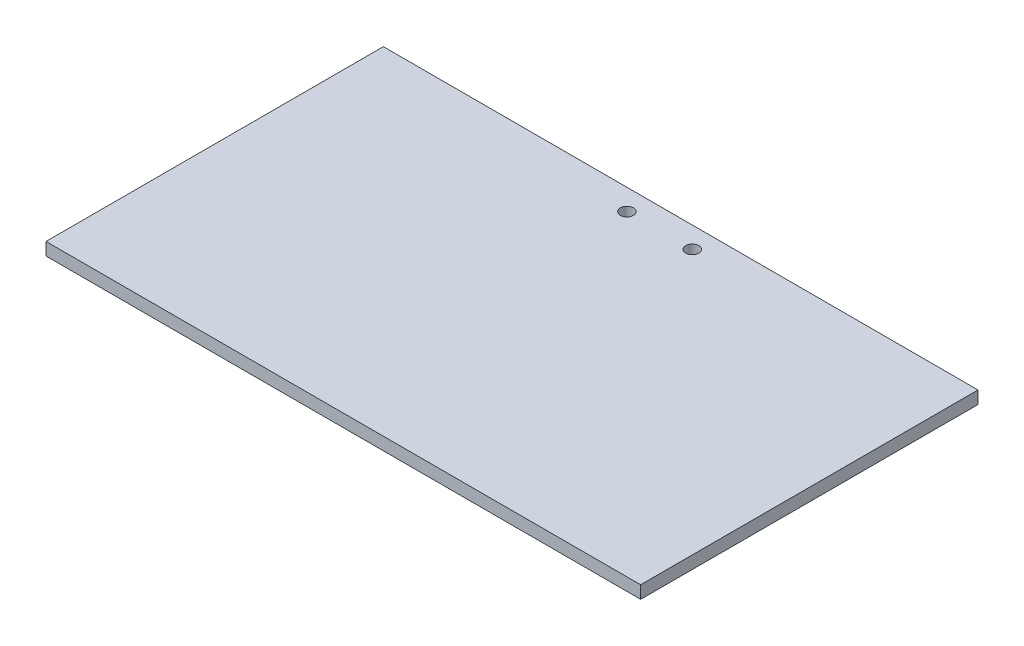
ISO-10303-21;
HEADER;
FILE_DESCRIPTION(('STEP AP214'),'2;1');
FILE_NAME('part.step','',(''),(''),'','','');
FILE_SCHEMA(('AUTOMOTIVE_DESIGN { 1 0 10303 214 1 1 1 1 }'));
ENDSEC;
DATA;
#1=APPLICATION_CONTEXT('core data for automotive mechanical design processes');
#2=APPLICATION_PROTOCOL_DEFINITION('international standard','automotive_design',2000,#1);
#3=PRODUCT_CONTEXT('',#1,'mechanical');
#4=PRODUCT('Part','Part','',(#3));
#5=PRODUCT_RELATED_PRODUCT_CATEGORY('part','',(#4));
#6=PRODUCT_DEFINITION_FORMATION('','',#4);
#7=PRODUCT_DEFINITION_CONTEXT('part definition',#1,'design');
#8=PRODUCT_DEFINITION('design','',#6,#7);
#9=PRODUCT_DEFINITION_SHAPE('','',#8);
#10=(LENGTH_UNIT() NAMED_UNIT(*) SI_UNIT(.MILLI.,.METRE.));
#11=(NAMED_UNIT(*) PLANE_ANGLE_UNIT() SI_UNIT($,.RADIAN.));
#12=(NAMED_UNIT(*) SI_UNIT($,.STERADIAN.) SOLID_ANGLE_UNIT());
#13=UNCERTAINTY_MEASURE_WITH_UNIT(LENGTH_MEASURE(1.E-05),#10,'distance_accuracy_value','');
#14=(GEOMETRIC_REPRESENTATION_CONTEXT(3) GLOBAL_UNCERTAINTY_ASSIGNED_CONTEXT((#13)) GLOBAL_UNIT_ASSIGNED_CONTEXT((#10,
#11,#12)) REPRESENTATION_CONTEXT('',''));
#15=CARTESIAN_POINT('',(0.,0.,0.));
#16=DIRECTION('',(0.,0.,1.));
#17=DIRECTION('',(1.,0.,0.));
#18=AXIS2_PLACEMENT_3D('',#15,#16,#17);
#19=CARTESIAN_POINT('',(70.5,3.,-40.));
#20=DIRECTION('',(-1.,0.,0.));
#21=DIRECTION('',(0.,0.,1.));
#22=AXIS2_PLACEMENT_3D('',#19,#20,#21);
#23=PLANE('',#22);
#24=DIRECTION('',(0.,0.,-1.));
#25=VECTOR('',#24,1.);
#26=CARTESIAN_POINT('',(70.5,0.,-40.));
#27=LINE('',#26,#25);
#28=CARTESIAN_POINT('',(70.5,0.,40.));
#29=VERTEX_POINT('',#28);
#30=CARTESIAN_POINT('',(70.5,0.,-40.));
#31=VERTEX_POINT('',#30);
#32=EDGE_CURVE('E95',#29,#31,#27,.T.);
#33=ORIENTED_EDGE('',*,*,#32,.T.);
#34=DIRECTION('',(0.,-1.,0.));
#35=VECTOR('',#34,1.);
#36=CARTESIAN_POINT('',(70.5,3.,-40.));
#37=LINE('',#36,#35);
#38=CARTESIAN_POINT('',(70.5,3.,-40.));
#39=VERTEX_POINT('',#38);
#40=EDGE_CURVE('E11',#39,#31,#37,.T.);
#41=ORIENTED_EDGE('',*,*,#40,.F.);
#42=DIRECTION('',(0.,0.,-1.));
#43=VECTOR('',#42,1.);
#44=CARTESIAN_POINT('',(70.5,3.,-40.));
#45=LINE('',#44,#43);
#46=CARTESIAN_POINT('',(70.5,3.,40.));
#47=VERTEX_POINT('',#46);
#48=EDGE_CURVE('E83',#47,#39,#45,.T.);
#49=ORIENTED_EDGE('',*,*,#48,.F.);
#50=DIRECTION('',(0.,-1.,0.));
#51=VECTOR('',#50,1.);
#52=CARTESIAN_POINT('',(70.5,3.,40.));
#53=LINE('',#52,#51);
#54=EDGE_CURVE('E91',#47,#29,#53,.T.);
#55=ORIENTED_EDGE('',*,*,#54,.T.);
#56=EDGE_LOOP('',(#33,#41,#49,#55));
#57=FACE_BOUND('',#56,.T.);
#58=ADVANCED_FACE('F32',(#57),#23,.F.);
#59=CARTESIAN_POINT('',(-70.5,3.,-40.));
#60=DIRECTION('',(0.,0.,1.));
#61=DIRECTION('',(1.,0.,0.));
#62=AXIS2_PLACEMENT_3D('',#59,#60,#61);
#63=PLANE('',#62);
#64=DIRECTION('',(-1.,0.,0.));
#65=VECTOR('',#64,1.);
#66=CARTESIAN_POINT('',(-70.5,0.,-40.));
#67=LINE('',#66,#65);
#68=CARTESIAN_POINT('',(-70.5,0.,-40.));
#69=VERTEX_POINT('',#68);
#70=EDGE_CURVE('E87',#31,#69,#67,.T.);
#71=ORIENTED_EDGE('',*,*,#70,.T.);
#72=DIRECTION('',(0.,-1.,0.));
#73=VECTOR('',#72,1.);
#74=CARTESIAN_POINT('',(-70.5,3.,-40.));
#75=LINE('',#74,#73);
#76=CARTESIAN_POINT('',(-70.5,3.,-40.));
#77=VERTEX_POINT('',#76);
#78=EDGE_CURVE('E40',#77,#69,#75,.T.);
#79=ORIENTED_EDGE('',*,*,#78,.F.);
#80=DIRECTION('',(-1.,0.,0.));
#81=VECTOR('',#80,1.);
#82=CARTESIAN_POINT('',(-70.5,3.,-40.));
#83=LINE('',#82,#81);
#84=EDGE_CURVE('E78',#39,#77,#83,.T.);
#85=ORIENTED_EDGE('',*,*,#84,.F.);
#86=ORIENTED_EDGE('',*,*,#40,.T.);
#87=EDGE_LOOP('',(#71,#79,#85,#86));
#88=FACE_BOUND('',#87,.T.);
#89=ADVANCED_FACE('F86',(#88),#63,.F.);
#90=CARTESIAN_POINT('',(-70.5,3.,-40.));
#91=DIRECTION('',(1.,0.,0.));
#92=DIRECTION('',(0.,0.,-1.));
#93=AXIS2_PLACEMENT_3D('',#90,#91,#92);
#94=PLANE('',#93);
#95=DIRECTION('',(0.,0.,1.));
#96=VECTOR('',#95,1.);
#97=CARTESIAN_POINT('',(-70.5,0.,-40.));
#98=LINE('',#97,#96);
#99=CARTESIAN_POINT('',(-70.5,0.,40.));
#100=VERTEX_POINT('',#99);
#101=EDGE_CURVE('E65',#69,#100,#98,.T.);
#102=ORIENTED_EDGE('',*,*,#101,.T.);
#103=DIRECTION('',(0.,-1.,0.));
#104=VECTOR('',#103,1.);
#105=CARTESIAN_POINT('',(-70.5,3.,40.));
#106=LINE('',#105,#104);
#107=CARTESIAN_POINT('',(-70.5,3.,40.));
#108=VERTEX_POINT('',#107);
#109=EDGE_CURVE('E88',#108,#100,#106,.T.);
#110=ORIENTED_EDGE('',*,*,#109,.F.);
#111=DIRECTION('',(0.,0.,1.));
#112=VECTOR('',#111,1.);
#113=CARTESIAN_POINT('',(-70.5,3.,-40.));
#114=LINE('',#113,#112);
#115=EDGE_CURVE('E81',#77,#108,#114,.T.);
#116=ORIENTED_EDGE('',*,*,#115,.F.);
#117=ORIENTED_EDGE('',*,*,#78,.T.);
#118=EDGE_LOOP('',(#102,#110,#116,#117));
#119=FACE_BOUND('',#118,.T.);
#120=ADVANCED_FACE('F89',(#119),#94,.F.);
#121=CARTESIAN_POINT('',(-70.5,3.,40.));
#122=DIRECTION('',(0.,0.,-1.));
#123=DIRECTION('',(-1.,0.,0.));
#124=AXIS2_PLACEMENT_3D('',#121,#122,#123);
#125=PLANE('',#124);
#126=DIRECTION('',(1.,0.,0.));
#127=VECTOR('',#126,1.);
#128=CARTESIAN_POINT('',(-70.5,0.,40.));
#129=LINE('',#128,#127);
#130=EDGE_CURVE('E71',#100,#29,#129,.T.);
#131=ORIENTED_EDGE('',*,*,#130,.T.);
#132=ORIENTED_EDGE('',*,*,#54,.F.);
#133=DIRECTION('',(1.,0.,0.));
#134=VECTOR('',#133,1.);
#135=CARTESIAN_POINT('',(-70.5,3.,40.));
#136=LINE('',#135,#134);
#137=EDGE_CURVE('E48',#108,#47,#136,.T.);
#138=ORIENTED_EDGE('',*,*,#137,.F.);
#139=ORIENTED_EDGE('',*,*,#109,.T.);
#140=EDGE_LOOP('',(#131,#132,#138,#139));
#141=FACE_BOUND('',#140,.T.);
#142=ADVANCED_FACE('F103',(#141),#125,.F.);
#143=CARTESIAN_POINT('',(0.,3.,0.));
#144=DIRECTION('',(0.,1.,0.));
#145=DIRECTION('',(0.,0.,1.));
#146=AXIS2_PLACEMENT_3D('',#143,#144,#145);
#147=PLANE('',#146);
#148=CARTESIAN_POINT('',(7.75,3.,-35.));
#149=DIRECTION('',(0.,1.,0.));
#150=DIRECTION('',(0.,0.,1.));
#151=AXIS2_PLACEMENT_3D('',#148,#149,#150);
#152=CIRCLE('',#151,1.55);
#153=CARTESIAN_POINT('',(7.75,3.,-33.45));
#154=VERTEX_POINT('',#153);
#155=EDGE_CURVE('E112',#154,#154,#152,.T.);
#156=ORIENTED_EDGE('',*,*,#155,.F.);
#157=EDGE_LOOP('',(#156));
#158=FACE_BOUND('',#157,.T.);
#159=CARTESIAN_POINT('',(-7.75,3.,-35.));
#160=DIRECTION('',(0.,1.,0.));
#161=DIRECTION('',(0.,0.,1.));
#162=AXIS2_PLACEMENT_3D('',#159,#160,#161);
#163=CIRCLE('',#162,1.55);
#164=CARTESIAN_POINT('',(-7.75,3.,-33.45));
#165=VERTEX_POINT('',#164);
#166=EDGE_CURVE('E109',#165,#165,#163,.T.);
#167=ORIENTED_EDGE('',*,*,#166,.F.);
#168=EDGE_LOOP('',(#167));
#169=FACE_BOUND('',#168,.T.);
#170=ORIENTED_EDGE('',*,*,#48,.T.);
#171=ORIENTED_EDGE('',*,*,#84,.T.);
#172=ORIENTED_EDGE('',*,*,#115,.T.);
#173=ORIENTED_EDGE('',*,*,#137,.T.);
#174=EDGE_LOOP('',(#170,#171,#172,#173));
#175=FACE_BOUND('',#174,.T.);
#176=ADVANCED_FACE('F79',(#158,#169,#175),#147,.T.);
#177=CARTESIAN_POINT('',(0.,0.,0.));
#178=DIRECTION('',(0.,1.,0.));
#179=DIRECTION('',(0.,0.,1.));
#180=AXIS2_PLACEMENT_3D('',#177,#178,#179);
#181=PLANE('',#180);
#182=CARTESIAN_POINT('',(7.75,0.,-35.));
#183=DIRECTION('',(0.,1.,0.));
#184=DIRECTION('',(0.,0.,1.));
#185=AXIS2_PLACEMENT_3D('',#182,#183,#184);
#186=CIRCLE('',#185,1.55);
#187=CARTESIAN_POINT('',(7.75,0.,-33.45));
#188=VERTEX_POINT('',#187);
#189=EDGE_CURVE('E115',#188,#188,#186,.T.);
#190=ORIENTED_EDGE('',*,*,#189,.T.);
#191=EDGE_LOOP('',(#190));
#192=FACE_BOUND('',#191,.T.);
#193=CARTESIAN_POINT('',(-7.75,0.,-35.));
#194=DIRECTION('',(0.,1.,0.));
#195=DIRECTION('',(0.,0.,1.));
#196=AXIS2_PLACEMENT_3D('',#193,#194,#195);
#197=CIRCLE('',#196,1.55);
#198=CARTESIAN_POINT('',(-7.75,0.,-33.45));
#199=VERTEX_POINT('',#198);
#200=EDGE_CURVE('E98',#199,#199,#197,.T.);
#201=ORIENTED_EDGE('',*,*,#200,.T.);
#202=EDGE_LOOP('',(#201));
#203=FACE_BOUND('',#202,.T.);
#204=ORIENTED_EDGE('',*,*,#32,.F.);
#205=ORIENTED_EDGE('',*,*,#130,.F.);
#206=ORIENTED_EDGE('',*,*,#101,.F.);
#207=ORIENTED_EDGE('',*,*,#70,.F.);
#208=EDGE_LOOP('',(#204,#205,#206,#207));
#209=FACE_BOUND('',#208,.T.);
#210=ADVANCED_FACE('F106',(#192,#203,#209),#181,.F.);
#211=CARTESIAN_POINT('',(-7.75,0.,-35.));
#212=DIRECTION('',(0.,1.,0.));
#213=DIRECTION('',(0.,0.,1.));
#214=AXIS2_PLACEMENT_3D('',#211,#212,#213);
#215=CYLINDRICAL_SURFACE('',#214,1.55);
#216=ORIENTED_EDGE('',*,*,#200,.F.);
#217=EDGE_LOOP('',(#216));
#218=FACE_BOUND('',#217,.T.);
#219=ORIENTED_EDGE('',*,*,#166,.T.);
#220=EDGE_LOOP('',(#219));
#221=FACE_BOUND('',#220,.T.);
#222=ADVANCED_FACE('F128',(#218,#221),#215,.F.);
#223=CARTESIAN_POINT('',(7.75,0.,-35.));
#224=DIRECTION('',(0.,1.,0.));
#225=DIRECTION('',(0.,0.,1.));
#226=AXIS2_PLACEMENT_3D('',#223,#224,#225);
#227=CYLINDRICAL_SURFACE('',#226,1.55);
#228=ORIENTED_EDGE('',*,*,#189,.F.);
#229=EDGE_LOOP('',(#228));
#230=FACE_BOUND('',#229,.T.);
#231=ORIENTED_EDGE('',*,*,#155,.T.);
#232=EDGE_LOOP('',(#231));
#233=FACE_BOUND('',#232,.T.);
#234=ADVANCED_FACE('F121',(#230,#233),#227,.F.);
#235=CLOSED_SHELL('',(#58,#89,#120,#142,#176,#210,#222,#234));
#236=MANIFOLD_SOLID_BREP('B2',#235);
#237=ADVANCED_BREP_SHAPE_REPRESENTATION('',(#18,#236),#14);
#238=SHAPE_DEFINITION_REPRESENTATION(#9,#237);
ENDSEC;
END-ISO-10303-21;
